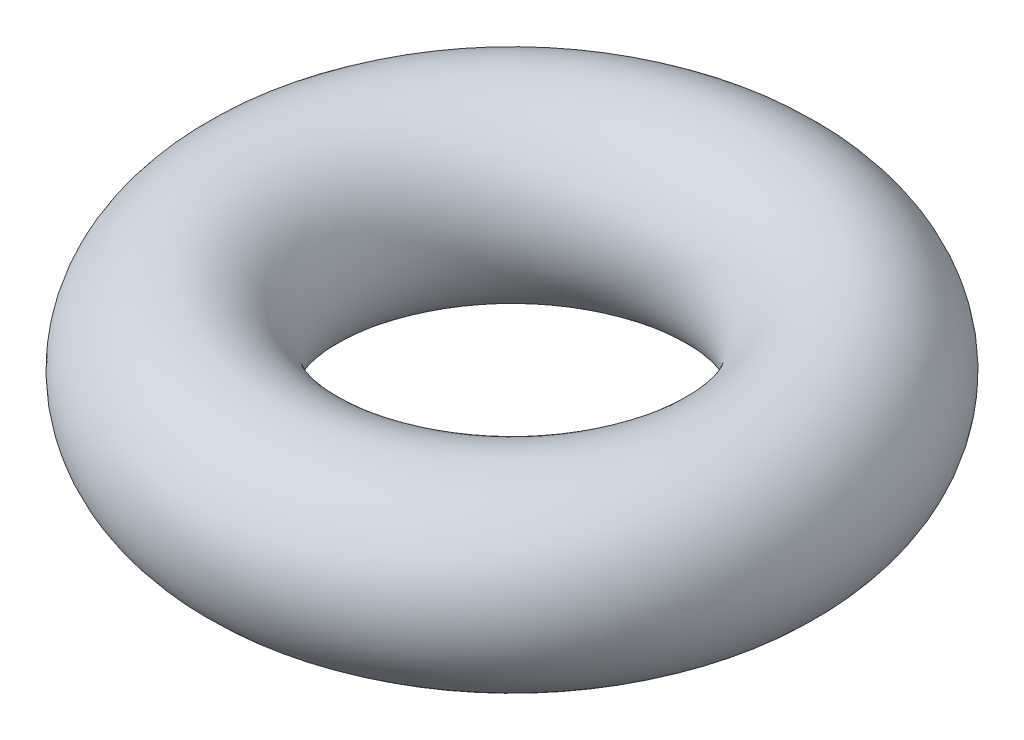
ISO-10303-21;
HEADER;
FILE_DESCRIPTION(('STEP AP214'),'2;1');
FILE_NAME('part.step','',(''),(''),'','','');
FILE_SCHEMA(('AUTOMOTIVE_DESIGN { 1 0 10303 214 1 1 1 1 }'));
ENDSEC;
DATA;
#1=APPLICATION_CONTEXT('core data for automotive mechanical design processes');
#2=APPLICATION_PROTOCOL_DEFINITION('international standard','automotive_design',2000,#1);
#3=PRODUCT_CONTEXT('',#1,'mechanical');
#4=PRODUCT('Part','Part','',(#3));
#5=PRODUCT_RELATED_PRODUCT_CATEGORY('part','',(#4));
#6=PRODUCT_DEFINITION_FORMATION('','',#4);
#7=PRODUCT_DEFINITION_CONTEXT('part definition',#1,'design');
#8=PRODUCT_DEFINITION('design','',#6,#7);
#9=PRODUCT_DEFINITION_SHAPE('','',#8);
#10=(LENGTH_UNIT() NAMED_UNIT(*) SI_UNIT(.MILLI.,.METRE.));
#11=(NAMED_UNIT(*) PLANE_ANGLE_UNIT() SI_UNIT($,.RADIAN.));
#12=(NAMED_UNIT(*) SI_UNIT($,.STERADIAN.) SOLID_ANGLE_UNIT());
#13=UNCERTAINTY_MEASURE_WITH_UNIT(LENGTH_MEASURE(1.E-05),#10,'distance_accuracy_value','');
#14=(GEOMETRIC_REPRESENTATION_CONTEXT(3) GLOBAL_UNCERTAINTY_ASSIGNED_CONTEXT((#13)) GLOBAL_UNIT_ASSIGNED_CONTEXT((#10,
#11,#12)) REPRESENTATION_CONTEXT('',''));
#15=CARTESIAN_POINT('',(0.,0.,0.));
#16=DIRECTION('',(0.,0.,1.));
#17=DIRECTION('',(1.,0.,0.));
#18=AXIS2_PLACEMENT_3D('',#15,#16,#17);
#19=CARTESIAN_POINT('',(0.,0.,0.));
#20=DIRECTION('',(0.,-1.,0.));
#21=DIRECTION('',(0.,0.,-1.));
#22=AXIS2_PLACEMENT_3D('',#19,#20,#21);
#23=TOROIDAL_SURFACE('',#22,2.3368,0.889);
#24=CARTESIAN_POINT('',(0.,0.,-3.2258));
#25=VERTEX_POINT('',#24);
#26=VERTEX_LOOP('',#25);
#27=FACE_BOUND('',#26,.T.);
#28=ADVANCED_FACE('F35',(#27),#23,.T.);
#29=CLOSED_SHELL('',(#28));
#30=MANIFOLD_SOLID_BREP('B2',#29);
#31=ADVANCED_BREP_SHAPE_REPRESENTATION('',(#18,#30),#14);
#32=SHAPE_DEFINITION_REPRESENTATION(#9,#31);
ENDSEC;
END-ISO-10303-21;
